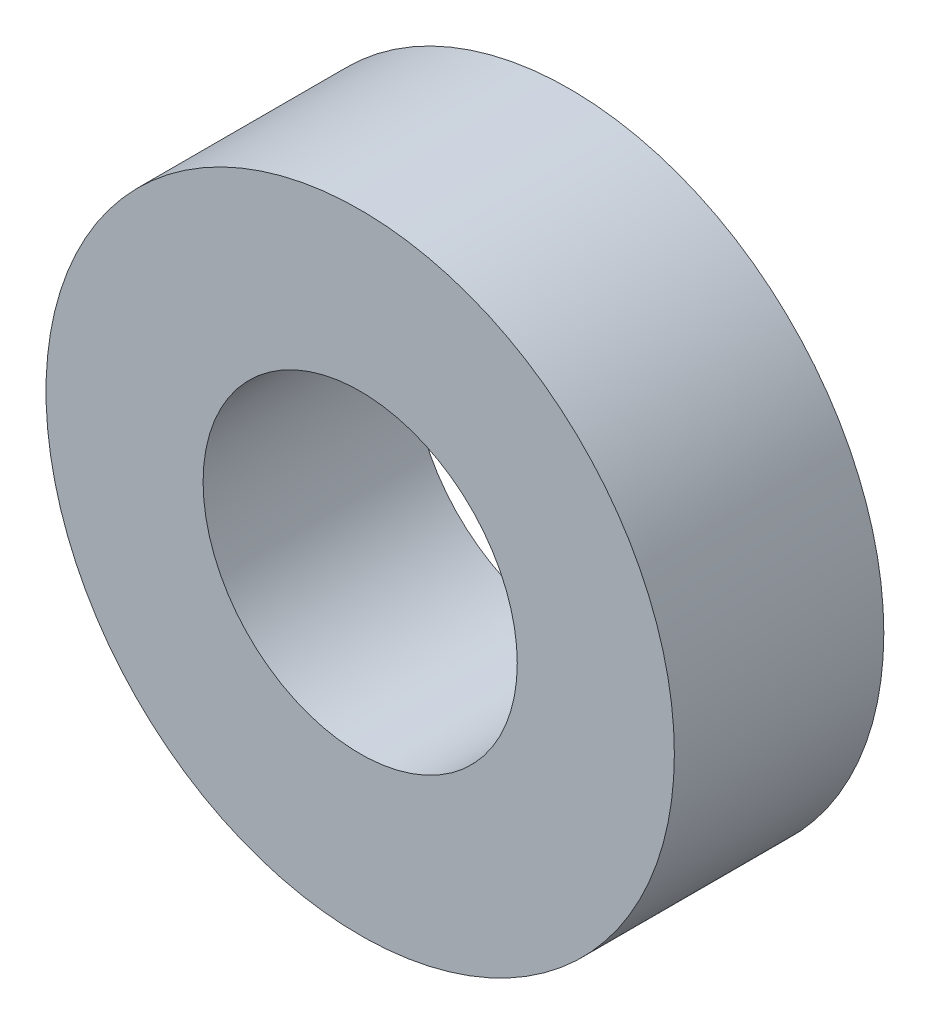
ISO-10303-21;
HEADER;
FILE_DESCRIPTION(('STEP AP214'),'2;1');
FILE_NAME('part.step','',(''),(''),'','','');
FILE_SCHEMA(('AUTOMOTIVE_DESIGN { 1 0 10303 214 1 1 1 1 }'));
ENDSEC;
DATA;
#1=APPLICATION_CONTEXT('core data for automotive mechanical design processes');
#2=APPLICATION_PROTOCOL_DEFINITION('international standard','automotive_design',2000,#1);
#3=PRODUCT_CONTEXT('',#1,'mechanical');
#4=PRODUCT('Part','Part','',(#3));
#5=PRODUCT_RELATED_PRODUCT_CATEGORY('part','',(#4));
#6=PRODUCT_DEFINITION_FORMATION('','',#4);
#7=PRODUCT_DEFINITION_CONTEXT('part definition',#1,'design');
#8=PRODUCT_DEFINITION('design','',#6,#7);
#9=PRODUCT_DEFINITION_SHAPE('','',#8);
#10=(LENGTH_UNIT() NAMED_UNIT(*) SI_UNIT(.MILLI.,.METRE.));
#11=(NAMED_UNIT(*) PLANE_ANGLE_UNIT() SI_UNIT($,.RADIAN.));
#12=(NAMED_UNIT(*) SI_UNIT($,.STERADIAN.) SOLID_ANGLE_UNIT());
#13=UNCERTAINTY_MEASURE_WITH_UNIT(LENGTH_MEASURE(1.E-05),#10,'distance_accuracy_value','');
#14=(GEOMETRIC_REPRESENTATION_CONTEXT(3) GLOBAL_UNCERTAINTY_ASSIGNED_CONTEXT((#13)) GLOBAL_UNIT_ASSIGNED_CONTEXT((#10,
#11,#12)) REPRESENTATION_CONTEXT('',''));
#15=CARTESIAN_POINT('',(0.,0.,0.));
#16=DIRECTION('',(0.,0.,1.));
#17=DIRECTION('',(1.,0.,0.));
#18=AXIS2_PLACEMENT_3D('',#15,#16,#17);
#19=CARTESIAN_POINT('',(0.,0.,2.));
#20=DIRECTION('',(0.,0.,1.));
#21=DIRECTION('',(1.,0.,0.));
#22=AXIS2_PLACEMENT_3D('',#19,#20,#21);
#23=PLANE('',#22);
#24=CARTESIAN_POINT('',(0.,0.,2.));
#25=DIRECTION('',(0.,0.,1.));
#26=DIRECTION('',(1.,0.,0.));
#27=AXIS2_PLACEMENT_3D('',#24,#25,#26);
#28=CIRCLE('',#27,3.);
#29=CARTESIAN_POINT('',(3.,0.,2.));
#30=VERTEX_POINT('',#29);
#31=EDGE_CURVE('E10',#30,#30,#28,.T.);
#32=ORIENTED_EDGE('',*,*,#31,.T.);
#33=EDGE_LOOP('',(#32));
#34=FACE_BOUND('',#33,.T.);
#35=CARTESIAN_POINT('',(0.,0.,2.));
#36=DIRECTION('',(0.,0.,1.));
#37=DIRECTION('',(1.,0.,0.));
#38=AXIS2_PLACEMENT_3D('',#35,#36,#37);
#39=CIRCLE('',#38,1.5);
#40=CARTESIAN_POINT('',(1.5,0.,2.));
#41=VERTEX_POINT('',#40);
#42=EDGE_CURVE('E42',#41,#41,#39,.T.);
#43=ORIENTED_EDGE('',*,*,#42,.F.);
#44=EDGE_LOOP('',(#43));
#45=FACE_BOUND('',#44,.T.);
#46=ADVANCED_FACE('F31',(#34,#45),#23,.T.);
#47=CARTESIAN_POINT('',(0.,0.,0.));
#48=DIRECTION('',(0.,0.,1.));
#49=DIRECTION('',(1.,0.,0.));
#50=AXIS2_PLACEMENT_3D('',#47,#48,#49);
#51=PLANE('',#50);
#52=CARTESIAN_POINT('',(0.,0.,0.));
#53=DIRECTION('',(0.,0.,1.));
#54=DIRECTION('',(1.,0.,0.));
#55=AXIS2_PLACEMENT_3D('',#52,#53,#54);
#56=CIRCLE('',#55,3.);
#57=CARTESIAN_POINT('',(3.,0.,0.));
#58=VERTEX_POINT('',#57);
#59=EDGE_CURVE('E35',#58,#58,#56,.T.);
#60=ORIENTED_EDGE('',*,*,#59,.F.);
#61=EDGE_LOOP('',(#60));
#62=FACE_BOUND('',#61,.T.);
#63=CARTESIAN_POINT('',(0.,0.,0.));
#64=DIRECTION('',(0.,0.,1.));
#65=DIRECTION('',(1.,0.,0.));
#66=AXIS2_PLACEMENT_3D('',#63,#64,#65);
#67=CIRCLE('',#66,1.5);
#68=CARTESIAN_POINT('',(1.5,0.,0.));
#69=VERTEX_POINT('',#68);
#70=EDGE_CURVE('E44',#69,#69,#67,.T.);
#71=ORIENTED_EDGE('',*,*,#70,.T.);
#72=EDGE_LOOP('',(#71));
#73=FACE_BOUND('',#72,.T.);
#74=ADVANCED_FACE('F54',(#62,#73),#51,.F.);
#75=CARTESIAN_POINT('',(0.,0.,2.));
#76=DIRECTION('',(0.,0.,-1.));
#77=DIRECTION('',(-1.,0.,0.));
#78=AXIS2_PLACEMENT_3D('',#75,#76,#77);
#79=CYLINDRICAL_SURFACE('',#78,3.);
#80=ORIENTED_EDGE('',*,*,#31,.F.);
#81=EDGE_LOOP('',(#80));
#82=FACE_BOUND('',#81,.T.);
#83=ORIENTED_EDGE('',*,*,#59,.T.);
#84=EDGE_LOOP('',(#83));
#85=FACE_BOUND('',#84,.T.);
#86=ADVANCED_FACE('F33',(#82,#85),#79,.T.);
#87=CARTESIAN_POINT('',(0.,0.,2.));
#88=DIRECTION('',(0.,0.,-1.));
#89=DIRECTION('',(-1.,0.,0.));
#90=AXIS2_PLACEMENT_3D('',#87,#88,#89);
#91=CYLINDRICAL_SURFACE('',#90,1.5);
#92=ORIENTED_EDGE('',*,*,#42,.T.);
#93=EDGE_LOOP('',(#92));
#94=FACE_BOUND('',#93,.T.);
#95=ORIENTED_EDGE('',*,*,#70,.F.);
#96=EDGE_LOOP('',(#95));
#97=FACE_BOUND('',#96,.T.);
#98=ADVANCED_FACE('F50',(#94,#97),#91,.F.);
#99=CLOSED_SHELL('',(#46,#74,#86,#98));
#100=MANIFOLD_SOLID_BREP('B2',#99);
#101=ADVANCED_BREP_SHAPE_REPRESENTATION('',(#18,#100),#14);
#102=SHAPE_DEFINITION_REPRESENTATION(#9,#101);
ENDSEC;
END-ISO-10303-21;
